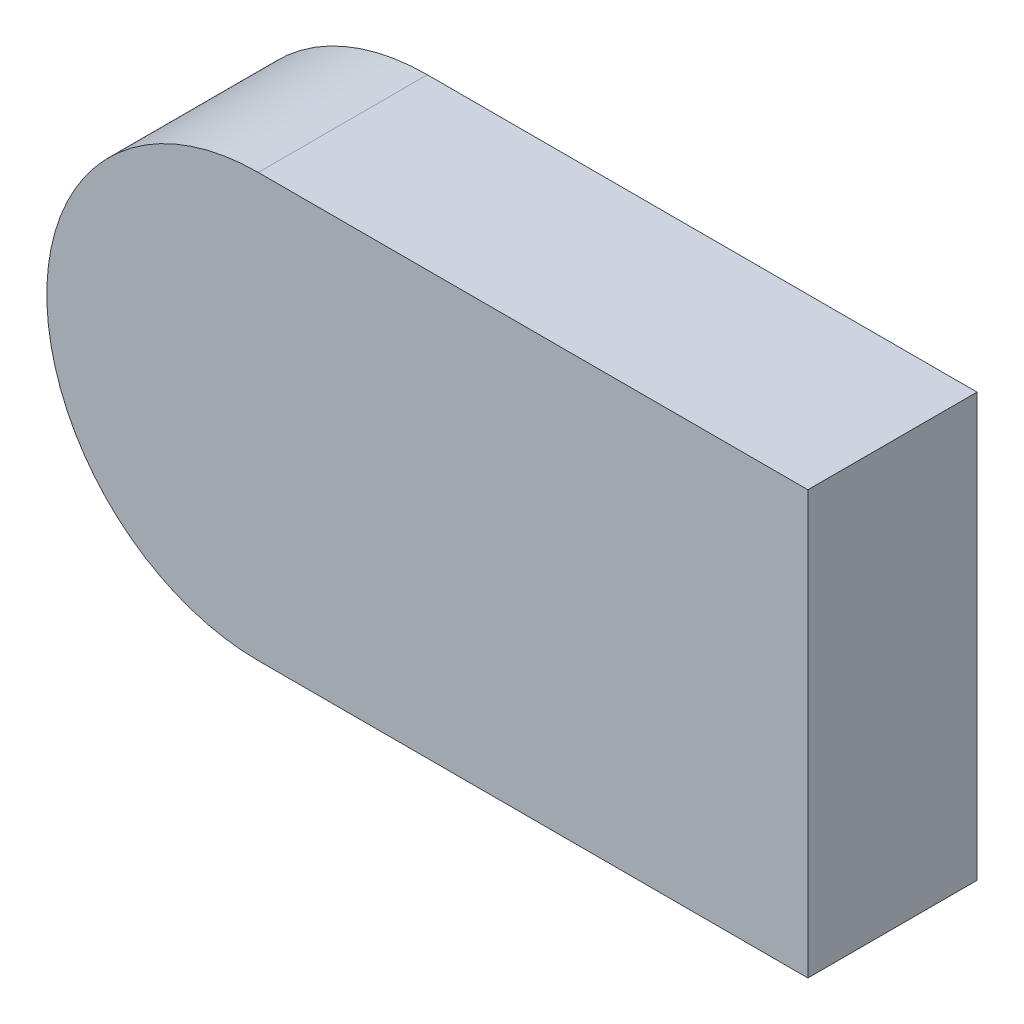
ISO-10303-21;
HEADER;
FILE_DESCRIPTION(('STEP AP214'),'2;1');
FILE_NAME('part.step','',(''),(''),'','','');
FILE_SCHEMA(('AUTOMOTIVE_DESIGN { 1 0 10303 214 1 1 1 1 }'));
ENDSEC;
DATA;
#1=APPLICATION_CONTEXT('core data for automotive mechanical design processes');
#2=APPLICATION_PROTOCOL_DEFINITION('international standard','automotive_design',2000,#1);
#3=PRODUCT_CONTEXT('',#1,'mechanical');
#4=PRODUCT('Part','Part','',(#3));
#5=PRODUCT_RELATED_PRODUCT_CATEGORY('part','',(#4));
#6=PRODUCT_DEFINITION_FORMATION('','',#4);
#7=PRODUCT_DEFINITION_CONTEXT('part definition',#1,'design');
#8=PRODUCT_DEFINITION('design','',#6,#7);
#9=PRODUCT_DEFINITION_SHAPE('','',#8);
#10=(LENGTH_UNIT() NAMED_UNIT(*) SI_UNIT(.MILLI.,.METRE.));
#11=(NAMED_UNIT(*) PLANE_ANGLE_UNIT() SI_UNIT($,.RADIAN.));
#12=(NAMED_UNIT(*) SI_UNIT($,.STERADIAN.) SOLID_ANGLE_UNIT());
#13=UNCERTAINTY_MEASURE_WITH_UNIT(LENGTH_MEASURE(1.E-05),#10,'distance_accuracy_value','');
#14=(GEOMETRIC_REPRESENTATION_CONTEXT(3) GLOBAL_UNCERTAINTY_ASSIGNED_CONTEXT((#13)) GLOBAL_UNIT_ASSIGNED_CONTEXT((#10,
#11,#12)) REPRESENTATION_CONTEXT('',''));
#15=CARTESIAN_POINT('',(0.,0.,0.));
#16=DIRECTION('',(0.,0.,1.));
#17=DIRECTION('',(1.,0.,0.));
#18=AXIS2_PLACEMENT_3D('',#15,#16,#17);
#19=CARTESIAN_POINT('',(2.05,-1.375,0.));
#20=DIRECTION('',(0.,-1.,0.));
#21=DIRECTION('',(-1.,0.,0.));
#22=AXIS2_PLACEMENT_3D('',#19,#20,#21);
#23=PLANE('',#22);
#24=DIRECTION('',(0.,0.,1.));
#25=VECTOR('',#24,1.);
#26=CARTESIAN_POINT('',(2.05,-1.375,0.));
#27=LINE('',#26,#25);
#28=CARTESIAN_POINT('',(2.05,-1.375,0.));
#29=VERTEX_POINT('',#28);
#30=CARTESIAN_POINT('',(2.05,-1.375,0.1));
#31=VERTEX_POINT('',#30);
#32=EDGE_CURVE('E11',#29,#31,#27,.T.);
#33=ORIENTED_EDGE('',*,*,#32,.T.);
#34=DIRECTION('',(-1.,0.,0.));
#35=VECTOR('',#34,1.);
#36=CARTESIAN_POINT('',(2.05,-1.375,0.1));
#37=LINE('',#36,#35);
#38=CARTESIAN_POINT('',(1.725,-1.375,0.1));
#39=VERTEX_POINT('',#38);
#40=EDGE_CURVE('E24',#31,#39,#37,.T.);
#41=ORIENTED_EDGE('',*,*,#40,.T.);
#42=DIRECTION('',(0.,0.,1.));
#43=VECTOR('',#42,1.);
#44=CARTESIAN_POINT('',(1.725,-1.375,0.));
#45=LINE('',#44,#43);
#46=CARTESIAN_POINT('',(1.725,-1.375,0.));
#47=VERTEX_POINT('',#46);
#48=EDGE_CURVE('E86',#47,#39,#45,.T.);
#49=ORIENTED_EDGE('',*,*,#48,.F.);
#50=DIRECTION('',(-1.,0.,0.));
#51=VECTOR('',#50,1.);
#52=CARTESIAN_POINT('',(2.05,-1.375,0.));
#53=LINE('',#52,#51);
#54=EDGE_CURVE('E83',#29,#47,#53,.T.);
#55=ORIENTED_EDGE('',*,*,#54,.F.);
#56=EDGE_LOOP('',(#33,#41,#49,#55));
#57=FACE_BOUND('',#56,.T.);
#58=ADVANCED_FACE('F17',(#57),#23,.T.);
#59=CARTESIAN_POINT('',(1.725,-1.25,0.));
#60=DIRECTION('',(0.,0.,-1.));
#61=DIRECTION('',(1.,0.,0.));
#62=AXIS2_PLACEMENT_3D('',#59,#60,#61);
#63=CYLINDRICAL_SURFACE('',#62,0.125);
#64=CARTESIAN_POINT('',(1.725,-1.25,0.));
#65=DIRECTION('',(0.,0.,1.));
#66=DIRECTION('',(1.,0.,0.));
#67=AXIS2_PLACEMENT_3D('',#64,#65,#66);
#68=CIRCLE('',#67,0.125);
#69=CARTESIAN_POINT('',(1.725,-1.125,0.));
#70=VERTEX_POINT('',#69);
#71=EDGE_CURVE('E80',#70,#47,#68,.T.);
#72=ORIENTED_EDGE('',*,*,#71,.T.);
#73=ORIENTED_EDGE('',*,*,#48,.T.);
#74=CARTESIAN_POINT('',(1.725,-1.25,0.1));
#75=DIRECTION('',(0.,0.,1.));
#76=DIRECTION('',(1.,0.,0.));
#77=AXIS2_PLACEMENT_3D('',#74,#75,#76);
#78=CIRCLE('',#77,0.125);
#79=CARTESIAN_POINT('',(1.725,-1.125,0.1));
#80=VERTEX_POINT('',#79);
#81=EDGE_CURVE('E78',#80,#39,#78,.T.);
#82=ORIENTED_EDGE('',*,*,#81,.F.);
#83=DIRECTION('',(0.,0.,1.));
#84=VECTOR('',#83,1.);
#85=CARTESIAN_POINT('',(1.725,-1.125,0.));
#86=LINE('',#85,#84);
#87=EDGE_CURVE('E67',#70,#80,#86,.T.);
#88=ORIENTED_EDGE('',*,*,#87,.F.);
#89=EDGE_LOOP('',(#72,#73,#82,#88));
#90=FACE_BOUND('',#89,.T.);
#91=ADVANCED_FACE('F89',(#90),#63,.T.);
#92=CARTESIAN_POINT('',(2.05,-1.125,0.));
#93=DIRECTION('',(0.,-1.,0.));
#94=DIRECTION('',(-1.,0.,0.));
#95=AXIS2_PLACEMENT_3D('',#92,#93,#94);
#96=PLANE('',#95);
#97=DIRECTION('',(-1.,0.,0.));
#98=VECTOR('',#97,1.);
#99=CARTESIAN_POINT('',(2.05,-1.125,0.));
#100=LINE('',#99,#98);
#101=CARTESIAN_POINT('',(2.05,-1.125,0.));
#102=VERTEX_POINT('',#101);
#103=EDGE_CURVE('E70',#102,#70,#100,.T.);
#104=ORIENTED_EDGE('',*,*,#103,.T.);
#105=ORIENTED_EDGE('',*,*,#87,.T.);
#106=DIRECTION('',(-1.,0.,0.));
#107=VECTOR('',#106,1.);
#108=CARTESIAN_POINT('',(2.05,-1.125,0.1));
#109=LINE('',#108,#107);
#110=CARTESIAN_POINT('',(2.05,-1.125,0.1));
#111=VERTEX_POINT('',#110);
#112=EDGE_CURVE('E61',#111,#80,#109,.T.);
#113=ORIENTED_EDGE('',*,*,#112,.F.);
#114=DIRECTION('',(0.,0.,1.));
#115=VECTOR('',#114,1.);
#116=CARTESIAN_POINT('',(2.05,-1.125,0.));
#117=LINE('',#116,#115);
#118=EDGE_CURVE('E51',#102,#111,#117,.T.);
#119=ORIENTED_EDGE('',*,*,#118,.F.);
#120=EDGE_LOOP('',(#104,#105,#113,#119));
#121=FACE_BOUND('',#120,.T.);
#122=ADVANCED_FACE('F65',(#121),#96,.F.);
#123=CARTESIAN_POINT('',(2.05,-1.375,0.));
#124=DIRECTION('',(-1.,0.,0.));
#125=DIRECTION('',(0.,1.,0.));
#126=AXIS2_PLACEMENT_3D('',#123,#124,#125);
#127=PLANE('',#126);
#128=DIRECTION('',(0.,1.,0.));
#129=VECTOR('',#128,1.);
#130=CARTESIAN_POINT('',(2.05,-1.375,0.));
#131=LINE('',#130,#129);
#132=EDGE_CURVE('E57',#29,#102,#131,.T.);
#133=ORIENTED_EDGE('',*,*,#132,.T.);
#134=ORIENTED_EDGE('',*,*,#118,.T.);
#135=DIRECTION('',(0.,1.,0.));
#136=VECTOR('',#135,1.);
#137=CARTESIAN_POINT('',(2.05,-1.375,0.1));
#138=LINE('',#137,#136);
#139=EDGE_CURVE('E55',#31,#111,#138,.T.);
#140=ORIENTED_EDGE('',*,*,#139,.F.);
#141=ORIENTED_EDGE('',*,*,#32,.F.);
#142=EDGE_LOOP('',(#133,#134,#140,#141));
#143=FACE_BOUND('',#142,.T.);
#144=ADVANCED_FACE('F53',(#143),#127,.F.);
#145=CARTESIAN_POINT('',(1.850342514613,-1.25,0.));
#146=DIRECTION('',(0.,0.,-1.));
#147=DIRECTION('',(-1.,0.,0.));
#148=AXIS2_PLACEMENT_3D('',#145,#146,#147);
#149=PLANE('',#148);
#150=ORIENTED_EDGE('',*,*,#54,.T.);
#151=ORIENTED_EDGE('',*,*,#71,.F.);
#152=ORIENTED_EDGE('',*,*,#103,.F.);
#153=ORIENTED_EDGE('',*,*,#132,.F.);
#154=EDGE_LOOP('',(#150,#151,#152,#153));
#155=FACE_BOUND('',#154,.T.);
#156=ADVANCED_FACE('F91',(#155),#149,.T.);
#157=CARTESIAN_POINT('',(1.850342514613,-1.25,0.1));
#158=DIRECTION('',(0.,0.,-1.));
#159=DIRECTION('',(-1.,0.,0.));
#160=AXIS2_PLACEMENT_3D('',#157,#158,#159);
#161=PLANE('',#160);
#162=ORIENTED_EDGE('',*,*,#139,.T.);
#163=ORIENTED_EDGE('',*,*,#112,.T.);
#164=ORIENTED_EDGE('',*,*,#81,.T.);
#165=ORIENTED_EDGE('',*,*,#40,.F.);
#166=EDGE_LOOP('',(#162,#163,#164,#165));
#167=FACE_BOUND('',#166,.T.);
#168=ADVANCED_FACE('F72',(#167),#161,.F.);
#169=CLOSED_SHELL('',(#58,#91,#122,#144,#156,#168));
#170=MANIFOLD_SOLID_BREP('B1',#169);
#171=ADVANCED_BREP_SHAPE_REPRESENTATION('',(#18,#170),#14);
#172=SHAPE_DEFINITION_REPRESENTATION(#9,#171);
ENDSEC;
END-ISO-10303-21;
